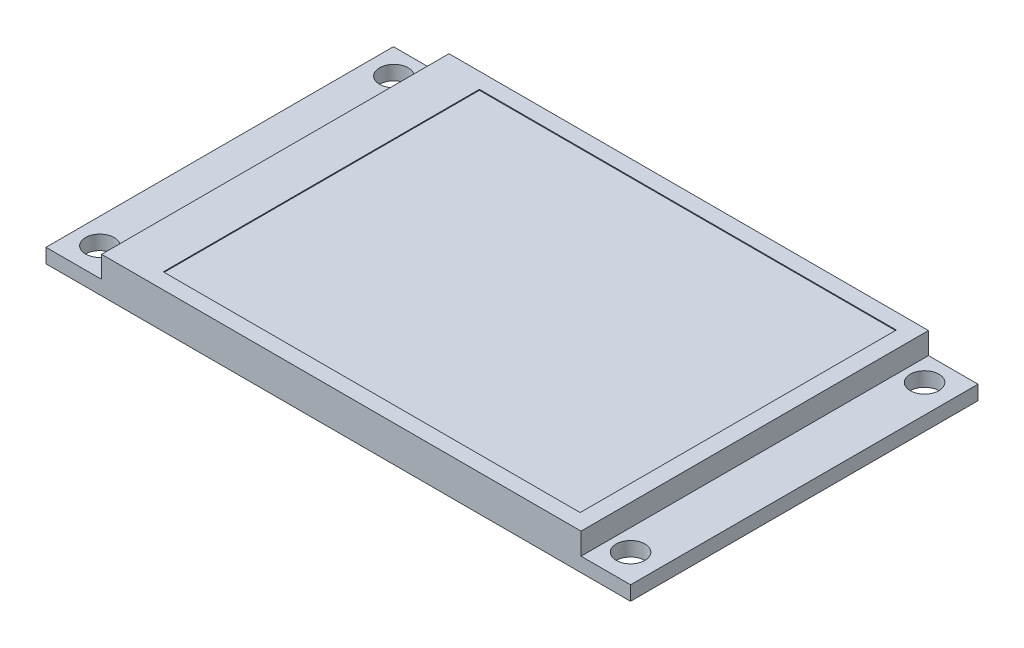
ISO-10303-21;
HEADER;
FILE_DESCRIPTION(('STEP AP214'),'2;1');
FILE_NAME('part.step','',(''),(''),'','','');
FILE_SCHEMA(('AUTOMOTIVE_DESIGN { 1 0 10303 214 1 1 1 1 }'));
ENDSEC;
DATA;
#1=APPLICATION_CONTEXT('core data for automotive mechanical design processes');
#2=APPLICATION_PROTOCOL_DEFINITION('international standard','automotive_design',2000,#1);
#3=PRODUCT_CONTEXT('',#1,'mechanical');
#4=PRODUCT('Part','Part','',(#3));
#5=PRODUCT_RELATED_PRODUCT_CATEGORY('part','',(#4));
#6=PRODUCT_DEFINITION_FORMATION('','',#4);
#7=PRODUCT_DEFINITION_CONTEXT('part definition',#1,'design');
#8=PRODUCT_DEFINITION('design','',#6,#7);
#9=PRODUCT_DEFINITION_SHAPE('','',#8);
#10=(LENGTH_UNIT() NAMED_UNIT(*) SI_UNIT(.MILLI.,.METRE.));
#11=(NAMED_UNIT(*) PLANE_ANGLE_UNIT() SI_UNIT($,.RADIAN.));
#12=(NAMED_UNIT(*) SI_UNIT($,.STERADIAN.) SOLID_ANGLE_UNIT());
#13=UNCERTAINTY_MEASURE_WITH_UNIT(LENGTH_MEASURE(1.E-05),#10,'distance_accuracy_value','');
#14=(GEOMETRIC_REPRESENTATION_CONTEXT(3) GLOBAL_UNCERTAINTY_ASSIGNED_CONTEXT((#13)) GLOBAL_UNIT_ASSIGNED_CONTEXT((#10,
#11,#12)) REPRESENTATION_CONTEXT('',''));
#15=CARTESIAN_POINT('',(0.,0.,0.));
#16=DIRECTION('',(0.,0.,1.));
#17=DIRECTION('',(1.,0.,0.));
#18=AXIS2_PLACEMENT_3D('',#15,#16,#17);
#19=CARTESIAN_POINT('',(0.,1.65,0.));
#20=DIRECTION('',(0.,-1.,0.));
#21=DIRECTION('',(0.,0.,-1.));
#22=AXIS2_PLACEMENT_3D('',#19,#20,#21);
#23=PLANE('',#22);
#24=CARTESIAN_POINT('',(-30.7,1.65,16.75));
#25=DIRECTION('',(0.,1.,0.));
#26=DIRECTION('',(0.,0.,1.));
#27=AXIS2_PLACEMENT_3D('',#24,#25,#26);
#28=CIRCLE('',#27,1.65);
#29=CARTESIAN_POINT('',(-30.7,1.65,18.4));
#30=VERTEX_POINT('',#29);
#31=EDGE_CURVE('E220',#30,#30,#28,.T.);
#32=ORIENTED_EDGE('',*,*,#31,.F.);
#33=EDGE_LOOP('',(#32));
#34=FACE_BOUND('',#33,.T.);
#35=CARTESIAN_POINT('',(-30.7,1.65,-17.1));
#36=DIRECTION('',(0.,1.,0.));
#37=DIRECTION('',(0.,0.,1.));
#38=AXIS2_PLACEMENT_3D('',#35,#36,#37);
#39=CIRCLE('',#38,1.65);
#40=CARTESIAN_POINT('',(-30.7,1.65,-15.45));
#41=VERTEX_POINT('',#40);
#42=EDGE_CURVE('E226',#41,#41,#39,.T.);
#43=ORIENTED_EDGE('',*,*,#42,.F.);
#44=EDGE_LOOP('',(#43));
#45=FACE_BOUND('',#44,.T.);
#46=DIRECTION('',(0.,0.,1.));
#47=VECTOR('',#46,1.);
#48=CARTESIAN_POINT('',(-27.25,1.65,20.));
#49=LINE('',#48,#47);
#50=CARTESIAN_POINT('',(-27.25,1.65,-20.));
#51=VERTEX_POINT('',#50);
#52=CARTESIAN_POINT('',(-27.25,1.65,20.));
#53=VERTEX_POINT('',#52);
#54=EDGE_CURVE('E158',#51,#53,#49,.T.);
#55=ORIENTED_EDGE('',*,*,#54,.F.);
#56=DIRECTION('',(-1.,0.,0.));
#57=VECTOR('',#56,1.);
#58=CARTESIAN_POINT('',(-33.65,1.65,-20.));
#59=LINE('',#58,#57);
#60=CARTESIAN_POINT('',(-33.65,1.65,-20.));
#61=VERTEX_POINT('',#60);
#62=EDGE_CURVE('E235',#51,#61,#59,.T.);
#63=ORIENTED_EDGE('',*,*,#62,.T.);
#64=DIRECTION('',(0.,0.,1.));
#65=VECTOR('',#64,1.);
#66=CARTESIAN_POINT('',(-33.65,1.65,20.));
#67=LINE('',#66,#65);
#68=CARTESIAN_POINT('',(-33.65,1.65,20.));
#69=VERTEX_POINT('',#68);
#70=EDGE_CURVE('E239',#61,#69,#67,.T.);
#71=ORIENTED_EDGE('',*,*,#70,.T.);
#72=DIRECTION('',(1.,0.,0.));
#73=VECTOR('',#72,1.);
#74=CARTESIAN_POINT('',(-33.65,1.65,20.));
#75=LINE('',#74,#73);
#76=EDGE_CURVE('E255',#69,#53,#75,.T.);
#77=ORIENTED_EDGE('',*,*,#76,.T.);
#78=EDGE_LOOP('',(#55,#63,#71,#77));
#79=FACE_BOUND('',#78,.T.);
#80=ADVANCED_FACE('F32',(#34,#45,#79),#23,.F.);
#81=CARTESIAN_POINT('',(30.4,1.65,-17.1));
#82=DIRECTION('',(0.,1.,0.));
#83=DIRECTION('',(0.,0.,1.));
#84=AXIS2_PLACEMENT_3D('',#81,#82,#83);
#85=CIRCLE('',#84,1.65);
#86=CARTESIAN_POINT('',(30.4,1.65,-15.45));
#87=VERTEX_POINT('',#86);
#88=EDGE_CURVE('E207',#87,#87,#85,.T.);
#89=ORIENTED_EDGE('',*,*,#88,.F.);
#90=EDGE_LOOP('',(#89));
#91=FACE_BOUND('',#90,.T.);
#92=CARTESIAN_POINT('',(30.4,1.65,16.75));
#93=DIRECTION('',(0.,1.,0.));
#94=DIRECTION('',(0.,0.,1.));
#95=AXIS2_PLACEMENT_3D('',#92,#93,#94);
#96=CIRCLE('',#95,1.65);
#97=CARTESIAN_POINT('',(30.4,1.65,18.4));
#98=VERTEX_POINT('',#97);
#99=EDGE_CURVE('E214',#98,#98,#96,.T.);
#100=ORIENTED_EDGE('',*,*,#99,.F.);
#101=EDGE_LOOP('',(#100));
#102=FACE_BOUND('',#101,.T.);
#103=DIRECTION('',(0.,0.,-1.));
#104=VECTOR('',#103,1.);
#105=CARTESIAN_POINT('',(27.95,1.65,20.));
#106=LINE('',#105,#104);
#107=CARTESIAN_POINT('',(27.95,1.65,20.));
#108=VERTEX_POINT('',#107);
#109=CARTESIAN_POINT('',(27.95,1.65,-20.));
#110=VERTEX_POINT('',#109);
#111=EDGE_CURVE('E57',#108,#110,#106,.T.);
#112=ORIENTED_EDGE('',*,*,#111,.F.);
#113=CARTESIAN_POINT('',(33.65,1.65,20.));
#114=VERTEX_POINT('',#113);
#115=EDGE_CURVE('E264',#108,#114,#75,.T.);
#116=ORIENTED_EDGE('',*,*,#115,.T.);
#117=DIRECTION('',(0.,0.,-1.));
#118=VECTOR('',#117,1.);
#119=CARTESIAN_POINT('',(33.65,1.65,20.));
#120=LINE('',#119,#118);
#121=CARTESIAN_POINT('',(33.65,1.65,-20.));
#122=VERTEX_POINT('',#121);
#123=EDGE_CURVE('E232',#114,#122,#120,.T.);
#124=ORIENTED_EDGE('',*,*,#123,.T.);
#125=EDGE_CURVE('E245',#122,#110,#59,.T.);
#126=ORIENTED_EDGE('',*,*,#125,.T.);
#127=EDGE_LOOP('',(#112,#116,#124,#126));
#128=FACE_BOUND('',#127,.T.);
#129=ADVANCED_FACE('F290',(#91,#102,#128),#23,.F.);
#130=CARTESIAN_POINT('',(0.,0.,0.));
#131=DIRECTION('',(0.,-1.,0.));
#132=DIRECTION('',(0.,0.,-1.));
#133=AXIS2_PLACEMENT_3D('',#130,#131,#132);
#134=PLANE('',#133);
#135=CARTESIAN_POINT('',(30.4,0.,16.75));
#136=DIRECTION('',(0.,1.,0.));
#137=DIRECTION('',(0.,0.,1.));
#138=AXIS2_PLACEMENT_3D('',#135,#136,#137);
#139=CIRCLE('',#138,1.65);
#140=CARTESIAN_POINT('',(30.4,0.,18.4));
#141=VERTEX_POINT('',#140);
#142=EDGE_CURVE('E212',#141,#141,#139,.T.);
#143=ORIENTED_EDGE('',*,*,#142,.T.);
#144=EDGE_LOOP('',(#143));
#145=FACE_BOUND('',#144,.T.);
#146=CARTESIAN_POINT('',(-30.7,0.,-17.1));
#147=DIRECTION('',(0.,1.,0.));
#148=DIRECTION('',(0.,0.,1.));
#149=AXIS2_PLACEMENT_3D('',#146,#147,#148);
#150=CIRCLE('',#149,1.65);
#151=CARTESIAN_POINT('',(-30.7,0.,-15.45));
#152=VERTEX_POINT('',#151);
#153=EDGE_CURVE('E223',#152,#152,#150,.T.);
#154=ORIENTED_EDGE('',*,*,#153,.T.);
#155=EDGE_LOOP('',(#154));
#156=FACE_BOUND('',#155,.T.);
#157=DIRECTION('',(0.,0.,-1.));
#158=VECTOR('',#157,1.);
#159=CARTESIAN_POINT('',(33.65,0.,20.));
#160=LINE('',#159,#158);
#161=CARTESIAN_POINT('',(33.65,0.,20.));
#162=VERTEX_POINT('',#161);
#163=CARTESIAN_POINT('',(33.65,0.,-20.));
#164=VERTEX_POINT('',#163);
#165=EDGE_CURVE('E229',#162,#164,#160,.T.);
#166=ORIENTED_EDGE('',*,*,#165,.F.);
#167=DIRECTION('',(1.,0.,0.));
#168=VECTOR('',#167,1.);
#169=CARTESIAN_POINT('',(-33.65,0.,20.));
#170=LINE('',#169,#168);
#171=CARTESIAN_POINT('',(-33.65,0.,20.));
#172=VERTEX_POINT('',#171);
#173=EDGE_CURVE('E236',#172,#162,#170,.T.);
#174=ORIENTED_EDGE('',*,*,#173,.F.);
#175=DIRECTION('',(0.,0.,1.));
#176=VECTOR('',#175,1.);
#177=CARTESIAN_POINT('',(-33.65,0.,20.));
#178=LINE('',#177,#176);
#179=CARTESIAN_POINT('',(-33.65,0.,-20.));
#180=VERTEX_POINT('',#179);
#181=EDGE_CURVE('E257',#180,#172,#178,.T.);
#182=ORIENTED_EDGE('',*,*,#181,.F.);
#183=DIRECTION('',(-1.,0.,0.));
#184=VECTOR('',#183,1.);
#185=CARTESIAN_POINT('',(-33.65,0.,-20.));
#186=LINE('',#185,#184);
#187=EDGE_CURVE('E259',#164,#180,#186,.T.);
#188=ORIENTED_EDGE('',*,*,#187,.F.);
#189=EDGE_LOOP('',(#166,#174,#182,#188));
#190=FACE_BOUND('',#189,.T.);
#191=CARTESIAN_POINT('',(-30.7,0.,16.75));
#192=DIRECTION('',(0.,1.,0.));
#193=DIRECTION('',(0.,0.,1.));
#194=AXIS2_PLACEMENT_3D('',#191,#192,#193);
#195=CIRCLE('',#194,1.65);
#196=CARTESIAN_POINT('',(-30.7,0.,18.4));
#197=VERTEX_POINT('',#196);
#198=EDGE_CURVE('E217',#197,#197,#195,.T.);
#199=ORIENTED_EDGE('',*,*,#198,.T.);
#200=EDGE_LOOP('',(#199));
#201=FACE_BOUND('',#200,.T.);
#202=CARTESIAN_POINT('',(30.4,0.,-17.1));
#203=DIRECTION('',(0.,1.,0.));
#204=DIRECTION('',(0.,0.,1.));
#205=AXIS2_PLACEMENT_3D('',#202,#203,#204);
#206=CIRCLE('',#205,1.65);
#207=CARTESIAN_POINT('',(30.4,0.,-15.45));
#208=VERTEX_POINT('',#207);
#209=EDGE_CURVE('E202',#208,#208,#206,.T.);
#210=ORIENTED_EDGE('',*,*,#209,.T.);
#211=EDGE_LOOP('',(#210));
#212=FACE_BOUND('',#211,.T.);
#213=ADVANCED_FACE('F296',(#145,#156,#190,#201,#212),#134,.T.);
#214=CARTESIAN_POINT('',(33.65,1.65,20.));
#215=DIRECTION('',(-1.,0.,0.));
#216=DIRECTION('',(0.,0.,1.));
#217=AXIS2_PLACEMENT_3D('',#214,#215,#216);
#218=PLANE('',#217);
#219=ORIENTED_EDGE('',*,*,#165,.T.);
#220=DIRECTION('',(0.,-1.,0.));
#221=VECTOR('',#220,1.);
#222=CARTESIAN_POINT('',(33.65,1.65,-20.));
#223=LINE('',#222,#221);
#224=EDGE_CURVE('E11',#122,#164,#223,.T.);
#225=ORIENTED_EDGE('',*,*,#224,.F.);
#226=ORIENTED_EDGE('',*,*,#123,.F.);
#227=DIRECTION('',(0.,-1.,0.));
#228=VECTOR('',#227,1.);
#229=CARTESIAN_POINT('',(33.65,1.65,20.));
#230=LINE('',#229,#228);
#231=EDGE_CURVE('E252',#114,#162,#230,.T.);
#232=ORIENTED_EDGE('',*,*,#231,.T.);
#233=EDGE_LOOP('',(#219,#225,#226,#232));
#234=FACE_BOUND('',#233,.T.);
#235=ADVANCED_FACE('F34',(#234),#218,.F.);
#236=CARTESIAN_POINT('',(-33.65,1.65,-20.));
#237=DIRECTION('',(0.,0.,1.));
#238=DIRECTION('',(1.,0.,0.));
#239=AXIS2_PLACEMENT_3D('',#236,#237,#238);
#240=PLANE('',#239);
#241=ORIENTED_EDGE('',*,*,#187,.T.);
#242=DIRECTION('',(0.,-1.,0.));
#243=VECTOR('',#242,1.);
#244=CARTESIAN_POINT('',(-33.65,1.65,-20.));
#245=LINE('',#244,#243);
#246=EDGE_CURVE('E41',#61,#180,#245,.T.);
#247=ORIENTED_EDGE('',*,*,#246,.F.);
#248=ORIENTED_EDGE('',*,*,#62,.F.);
#249=DIRECTION('',(0.,-1.,0.));
#250=VECTOR('',#249,1.);
#251=CARTESIAN_POINT('',(-27.25,4.15,-20.));
#252=LINE('',#251,#250);
#253=CARTESIAN_POINT('',(-27.25,4.15,-20.));
#254=VERTEX_POINT('',#253);
#255=EDGE_CURVE('E171',#254,#51,#252,.T.);
#256=ORIENTED_EDGE('',*,*,#255,.F.);
#257=DIRECTION('',(-1.,0.,0.));
#258=VECTOR('',#257,1.);
#259=CARTESIAN_POINT('',(-27.25,4.15,-20.));
#260=LINE('',#259,#258);
#261=CARTESIAN_POINT('',(27.95,4.15,-20.));
#262=VERTEX_POINT('',#261);
#263=EDGE_CURVE('E169',#262,#254,#260,.T.);
#264=ORIENTED_EDGE('',*,*,#263,.F.);
#265=DIRECTION('',(0.,-1.,0.));
#266=VECTOR('',#265,1.);
#267=CARTESIAN_POINT('',(27.95,4.15,-20.));
#268=LINE('',#267,#266);
#269=EDGE_CURVE('E182',#262,#110,#268,.T.);
#270=ORIENTED_EDGE('',*,*,#269,.T.);
#271=ORIENTED_EDGE('',*,*,#125,.F.);
#272=ORIENTED_EDGE('',*,*,#224,.T.);
#273=EDGE_LOOP('',(#241,#247,#248,#256,#264,#270,#271,#272));
#274=FACE_BOUND('',#273,.T.);
#275=ADVANCED_FACE('F286',(#274),#240,.F.);
#276=CARTESIAN_POINT('',(-33.65,1.65,20.));
#277=DIRECTION('',(1.,0.,0.));
#278=DIRECTION('',(0.,0.,-1.));
#279=AXIS2_PLACEMENT_3D('',#276,#277,#278);
#280=PLANE('',#279);
#281=ORIENTED_EDGE('',*,*,#181,.T.);
#282=DIRECTION('',(0.,-1.,0.));
#283=VECTOR('',#282,1.);
#284=CARTESIAN_POINT('',(-33.65,1.65,20.));
#285=LINE('',#284,#283);
#286=EDGE_CURVE('E249',#69,#172,#285,.T.);
#287=ORIENTED_EDGE('',*,*,#286,.F.);
#288=ORIENTED_EDGE('',*,*,#70,.F.);
#289=ORIENTED_EDGE('',*,*,#246,.T.);
#290=EDGE_LOOP('',(#281,#287,#288,#289));
#291=FACE_BOUND('',#290,.T.);
#292=ADVANCED_FACE('F272',(#291),#280,.F.);
#293=CARTESIAN_POINT('',(-33.65,1.65,20.));
#294=DIRECTION('',(0.,0.,-1.));
#295=DIRECTION('',(-1.,0.,0.));
#296=AXIS2_PLACEMENT_3D('',#293,#294,#295);
#297=PLANE('',#296);
#298=ORIENTED_EDGE('',*,*,#173,.T.);
#299=ORIENTED_EDGE('',*,*,#231,.F.);
#300=ORIENTED_EDGE('',*,*,#115,.F.);
#301=DIRECTION('',(0.,-1.,0.));
#302=VECTOR('',#301,1.);
#303=CARTESIAN_POINT('',(27.95,4.15,20.));
#304=LINE('',#303,#302);
#305=CARTESIAN_POINT('',(27.95,4.15,20.));
#306=VERTEX_POINT('',#305);
#307=EDGE_CURVE('E187',#306,#108,#304,.T.);
#308=ORIENTED_EDGE('',*,*,#307,.F.);
#309=DIRECTION('',(1.,0.,0.));
#310=VECTOR('',#309,1.);
#311=CARTESIAN_POINT('',(-27.25,4.15,20.));
#312=LINE('',#311,#310);
#313=CARTESIAN_POINT('',(-27.25,4.15,20.));
#314=VERTEX_POINT('',#313);
#315=EDGE_CURVE('E165',#314,#306,#312,.T.);
#316=ORIENTED_EDGE('',*,*,#315,.F.);
#317=DIRECTION('',(0.,-1.,0.));
#318=VECTOR('',#317,1.);
#319=CARTESIAN_POINT('',(-27.25,4.15,20.));
#320=LINE('',#319,#318);
#321=EDGE_CURVE('E193',#314,#53,#320,.T.);
#322=ORIENTED_EDGE('',*,*,#321,.T.);
#323=ORIENTED_EDGE('',*,*,#76,.F.);
#324=ORIENTED_EDGE('',*,*,#286,.T.);
#325=EDGE_LOOP('',(#298,#299,#300,#308,#316,#322,#323,#324));
#326=FACE_BOUND('',#325,.T.);
#327=ADVANCED_FACE('F275',(#326),#297,.F.);
#328=CARTESIAN_POINT('',(-30.7,1.65,-17.1));
#329=DIRECTION('',(0.,-1.,0.));
#330=DIRECTION('',(0.,0.,-1.));
#331=AXIS2_PLACEMENT_3D('',#328,#329,#330);
#332=CYLINDRICAL_SURFACE('',#331,1.65);
#333=ORIENTED_EDGE('',*,*,#42,.T.);
#334=EDGE_LOOP('',(#333));
#335=FACE_BOUND('',#334,.T.);
#336=ORIENTED_EDGE('',*,*,#153,.F.);
#337=EDGE_LOOP('',(#336));
#338=FACE_BOUND('',#337,.T.);
#339=ADVANCED_FACE('F277',(#335,#338),#332,.F.);
#340=CARTESIAN_POINT('',(-30.7,1.65,16.75));
#341=DIRECTION('',(0.,-1.,0.));
#342=DIRECTION('',(0.,0.,-1.));
#343=AXIS2_PLACEMENT_3D('',#340,#341,#342);
#344=CYLINDRICAL_SURFACE('',#343,1.65);
#345=ORIENTED_EDGE('',*,*,#31,.T.);
#346=EDGE_LOOP('',(#345));
#347=FACE_BOUND('',#346,.T.);
#348=ORIENTED_EDGE('',*,*,#198,.F.);
#349=EDGE_LOOP('',(#348));
#350=FACE_BOUND('',#349,.T.);
#351=ADVANCED_FACE('F283',(#347,#350),#344,.F.);
#352=CARTESIAN_POINT('',(30.4,1.65,16.75));
#353=DIRECTION('',(0.,-1.,0.));
#354=DIRECTION('',(0.,0.,-1.));
#355=AXIS2_PLACEMENT_3D('',#352,#353,#354);
#356=CYLINDRICAL_SURFACE('',#355,1.65);
#357=ORIENTED_EDGE('',*,*,#99,.T.);
#358=EDGE_LOOP('',(#357));
#359=FACE_BOUND('',#358,.T.);
#360=ORIENTED_EDGE('',*,*,#142,.F.);
#361=EDGE_LOOP('',(#360));
#362=FACE_BOUND('',#361,.T.);
#363=ADVANCED_FACE('F316',(#359,#362),#356,.F.);
#364=CARTESIAN_POINT('',(30.4,1.65,-17.1));
#365=DIRECTION('',(0.,-1.,0.));
#366=DIRECTION('',(0.,0.,-1.));
#367=AXIS2_PLACEMENT_3D('',#364,#365,#366);
#368=CYLINDRICAL_SURFACE('',#367,1.65);
#369=ORIENTED_EDGE('',*,*,#88,.T.);
#370=EDGE_LOOP('',(#369));
#371=FACE_BOUND('',#370,.T.);
#372=ORIENTED_EDGE('',*,*,#209,.F.);
#373=EDGE_LOOP('',(#372));
#374=FACE_BOUND('',#373,.T.);
#375=ADVANCED_FACE('F321',(#371,#374),#368,.F.);
#376=CARTESIAN_POINT('',(-27.25,4.15,20.));
#377=DIRECTION('',(1.,0.,0.));
#378=DIRECTION('',(0.,0.,-1.));
#379=AXIS2_PLACEMENT_3D('',#376,#377,#378);
#380=PLANE('',#379);
#381=ORIENTED_EDGE('',*,*,#54,.T.);
#382=ORIENTED_EDGE('',*,*,#321,.F.);
#383=DIRECTION('',(0.,0.,1.));
#384=VECTOR('',#383,1.);
#385=CARTESIAN_POINT('',(-27.25,4.15,20.));
#386=LINE('',#385,#384);
#387=EDGE_CURVE('E162',#254,#314,#386,.T.);
#388=ORIENTED_EDGE('',*,*,#387,.F.);
#389=ORIENTED_EDGE('',*,*,#255,.T.);
#390=EDGE_LOOP('',(#381,#382,#388,#389));
#391=FACE_BOUND('',#390,.T.);
#392=ADVANCED_FACE('F327',(#391),#380,.F.);
#393=CARTESIAN_POINT('',(27.95,4.15,20.));
#394=DIRECTION('',(-1.,0.,0.));
#395=DIRECTION('',(0.,0.,1.));
#396=AXIS2_PLACEMENT_3D('',#393,#394,#395);
#397=PLANE('',#396);
#398=ORIENTED_EDGE('',*,*,#111,.T.);
#399=ORIENTED_EDGE('',*,*,#269,.F.);
#400=DIRECTION('',(0.,0.,-1.));
#401=VECTOR('',#400,1.);
#402=CARTESIAN_POINT('',(27.95,4.15,20.));
#403=LINE('',#402,#401);
#404=EDGE_CURVE('E167',#306,#262,#403,.T.);
#405=ORIENTED_EDGE('',*,*,#404,.F.);
#406=ORIENTED_EDGE('',*,*,#307,.T.);
#407=EDGE_LOOP('',(#398,#399,#405,#406));
#408=FACE_BOUND('',#407,.T.);
#409=ADVANCED_FACE('F331',(#408),#397,.F.);
#410=CARTESIAN_POINT('',(0.,4.15,0.));
#411=DIRECTION('',(0.,-1.,0.));
#412=DIRECTION('',(0.,0.,-1.));
#413=AXIS2_PLACEMENT_3D('',#410,#411,#412);
#414=PLANE('',#413);
#415=DIRECTION('',(1.,0.,0.));
#416=VECTOR('',#415,1.);
#417=CARTESIAN_POINT('',(-21.95,4.15,18.2));
#418=LINE('',#417,#416);
#419=CARTESIAN_POINT('',(-21.95,4.15,18.2));
#420=VERTEX_POINT('',#419);
#421=CARTESIAN_POINT('',(26.05,4.15,18.2));
#422=VERTEX_POINT('',#421);
#423=EDGE_CURVE('E152',#420,#422,#418,.T.);
#424=ORIENTED_EDGE('',*,*,#423,.F.);
#425=DIRECTION('',(0.,0.,1.));
#426=VECTOR('',#425,1.);
#427=CARTESIAN_POINT('',(-21.95,4.15,-18.2));
#428=LINE('',#427,#426);
#429=CARTESIAN_POINT('',(-21.95,4.15,-18.2));
#430=VERTEX_POINT('',#429);
#431=EDGE_CURVE('E49',#430,#420,#428,.T.);
#432=ORIENTED_EDGE('',*,*,#431,.F.);
#433=DIRECTION('',(-1.,0.,0.));
#434=VECTOR('',#433,1.);
#435=CARTESIAN_POINT('',(-21.95,4.15,-18.2));
#436=LINE('',#435,#434);
#437=CARTESIAN_POINT('',(26.05,4.15,-18.2));
#438=VERTEX_POINT('',#437);
#439=EDGE_CURVE('E143',#438,#430,#436,.T.);
#440=ORIENTED_EDGE('',*,*,#439,.F.);
#441=DIRECTION('',(0.,0.,-1.));
#442=VECTOR('',#441,1.);
#443=CARTESIAN_POINT('',(26.05,4.15,-18.2));
#444=LINE('',#443,#442);
#445=EDGE_CURVE('E146',#422,#438,#444,.T.);
#446=ORIENTED_EDGE('',*,*,#445,.F.);
#447=EDGE_LOOP('',(#424,#432,#440,#446));
#448=FACE_BOUND('',#447,.T.);
#449=ORIENTED_EDGE('',*,*,#387,.T.);
#450=ORIENTED_EDGE('',*,*,#315,.T.);
#451=ORIENTED_EDGE('',*,*,#404,.T.);
#452=ORIENTED_EDGE('',*,*,#263,.T.);
#453=EDGE_LOOP('',(#449,#450,#451,#452));
#454=FACE_BOUND('',#453,.T.);
#455=ADVANCED_FACE('F334',(#448,#454),#414,.F.);
#456=CARTESIAN_POINT('',(-21.95,4.05,-18.2));
#457=DIRECTION('',(-1.,0.,0.));
#458=DIRECTION('',(0.,0.,1.));
#459=AXIS2_PLACEMENT_3D('',#456,#457,#458);
#460=PLANE('',#459);
#461=ORIENTED_EDGE('',*,*,#431,.T.);
#462=DIRECTION('',(0.,1.,0.));
#463=VECTOR('',#462,1.);
#464=CARTESIAN_POINT('',(-21.95,4.05,18.2));
#465=LINE('',#464,#463);
#466=CARTESIAN_POINT('',(-21.95,4.05,18.2));
#467=VERTEX_POINT('',#466);
#468=EDGE_CURVE('E121',#467,#420,#465,.T.);
#469=ORIENTED_EDGE('',*,*,#468,.F.);
#470=DIRECTION('',(0.,0.,1.));
#471=VECTOR('',#470,1.);
#472=CARTESIAN_POINT('',(-21.95,4.05,-18.2));
#473=LINE('',#472,#471);
#474=CARTESIAN_POINT('',(-21.95,4.05,-18.2));
#475=VERTEX_POINT('',#474);
#476=EDGE_CURVE('E125',#475,#467,#473,.T.);
#477=ORIENTED_EDGE('',*,*,#476,.F.);
#478=DIRECTION('',(0.,1.,0.));
#479=VECTOR('',#478,1.);
#480=CARTESIAN_POINT('',(-21.95,4.05,-18.2));
#481=LINE('',#480,#479);
#482=EDGE_CURVE('E156',#475,#430,#481,.T.);
#483=ORIENTED_EDGE('',*,*,#482,.T.);
#484=EDGE_LOOP('',(#461,#469,#477,#483));
#485=FACE_BOUND('',#484,.T.);
#486=ADVANCED_FACE('F123',(#485),#460,.F.);
#487=CARTESIAN_POINT('',(-21.95,4.05,-18.2));
#488=DIRECTION('',(0.,0.,-1.));
#489=DIRECTION('',(-1.,0.,0.));
#490=AXIS2_PLACEMENT_3D('',#487,#488,#489);
#491=PLANE('',#490);
#492=ORIENTED_EDGE('',*,*,#439,.T.);
#493=ORIENTED_EDGE('',*,*,#482,.F.);
#494=DIRECTION('',(-1.,0.,0.));
#495=VECTOR('',#494,1.);
#496=CARTESIAN_POINT('',(-21.95,4.05,-18.2));
#497=LINE('',#496,#495);
#498=CARTESIAN_POINT('',(26.05,4.05,-18.2));
#499=VERTEX_POINT('',#498);
#500=EDGE_CURVE('E131',#499,#475,#497,.T.);
#501=ORIENTED_EDGE('',*,*,#500,.F.);
#502=DIRECTION('',(0.,1.,0.));
#503=VECTOR('',#502,1.);
#504=CARTESIAN_POINT('',(26.05,4.05,-18.2));
#505=LINE('',#504,#503);
#506=EDGE_CURVE('E159',#499,#438,#505,.T.);
#507=ORIENTED_EDGE('',*,*,#506,.T.);
#508=EDGE_LOOP('',(#492,#493,#501,#507));
#509=FACE_BOUND('',#508,.T.);
#510=ADVANCED_FACE('F341',(#509),#491,.F.);
#511=CARTESIAN_POINT('',(26.05,4.05,-18.2));
#512=DIRECTION('',(1.,0.,0.));
#513=DIRECTION('',(0.,0.,-1.));
#514=AXIS2_PLACEMENT_3D('',#511,#512,#513);
#515=PLANE('',#514);
#516=ORIENTED_EDGE('',*,*,#445,.T.);
#517=ORIENTED_EDGE('',*,*,#506,.F.);
#518=DIRECTION('',(0.,0.,-1.));
#519=VECTOR('',#518,1.);
#520=CARTESIAN_POINT('',(26.05,4.05,-18.2));
#521=LINE('',#520,#519);
#522=CARTESIAN_POINT('',(26.05,4.05,18.2));
#523=VERTEX_POINT('',#522);
#524=EDGE_CURVE('E139',#523,#499,#521,.T.);
#525=ORIENTED_EDGE('',*,*,#524,.F.);
#526=DIRECTION('',(0.,1.,0.));
#527=VECTOR('',#526,1.);
#528=CARTESIAN_POINT('',(26.05,4.05,18.2));
#529=LINE('',#528,#527);
#530=EDGE_CURVE('E130',#523,#422,#529,.T.);
#531=ORIENTED_EDGE('',*,*,#530,.T.);
#532=EDGE_LOOP('',(#516,#517,#525,#531));
#533=FACE_BOUND('',#532,.T.);
#534=ADVANCED_FACE('F344',(#533),#515,.F.);
#535=CARTESIAN_POINT('',(-21.95,4.05,18.2));
#536=DIRECTION('',(0.,0.,1.));
#537=DIRECTION('',(1.,0.,0.));
#538=AXIS2_PLACEMENT_3D('',#535,#536,#537);
#539=PLANE('',#538);
#540=ORIENTED_EDGE('',*,*,#423,.T.);
#541=ORIENTED_EDGE('',*,*,#530,.F.);
#542=DIRECTION('',(1.,0.,0.));
#543=VECTOR('',#542,1.);
#544=CARTESIAN_POINT('',(-21.95,4.05,18.2));
#545=LINE('',#544,#543);
#546=EDGE_CURVE('E134',#467,#523,#545,.T.);
#547=ORIENTED_EDGE('',*,*,#546,.F.);
#548=ORIENTED_EDGE('',*,*,#468,.T.);
#549=EDGE_LOOP('',(#540,#541,#547,#548));
#550=FACE_BOUND('',#549,.T.);
#551=ADVANCED_FACE('F135',(#550),#539,.F.);
#552=CARTESIAN_POINT('',(0.,4.05,0.));
#553=DIRECTION('',(0.,1.,0.));
#554=DIRECTION('',(0.,0.,1.));
#555=AXIS2_PLACEMENT_3D('',#552,#553,#554);
#556=PLANE('',#555);
#557=ORIENTED_EDGE('',*,*,#476,.T.);
#558=ORIENTED_EDGE('',*,*,#546,.T.);
#559=ORIENTED_EDGE('',*,*,#524,.T.);
#560=ORIENTED_EDGE('',*,*,#500,.T.);
#561=EDGE_LOOP('',(#557,#558,#559,#560));
#562=FACE_BOUND('',#561,.T.);
#563=ADVANCED_FACE('F141',(#562),#556,.T.);
#564=CLOSED_SHELL('',(#80,#129,#213,#235,#275,#292,#327,#339,#351,#363,#375,#392,#409,#455,#486,
#510,#534,#551,#563));
#565=MANIFOLD_SOLID_BREP('B2',#564);
#566=ADVANCED_BREP_SHAPE_REPRESENTATION('',(#18,#565),#14);
#567=SHAPE_DEFINITION_REPRESENTATION(#9,#566);
ENDSEC;
END-ISO-10303-21;
